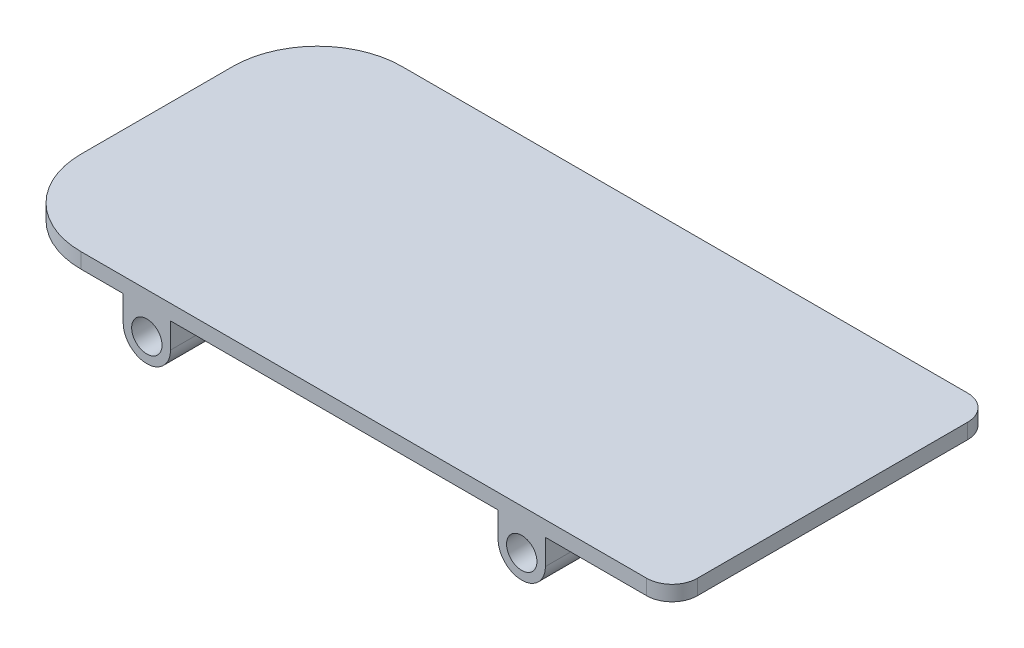
ISO-10303-21;
HEADER;
FILE_DESCRIPTION(('STEP AP214'),'2;1');
FILE_NAME('part.step','',(''),(''),'','','');
FILE_SCHEMA(('AUTOMOTIVE_DESIGN { 1 0 10303 214 1 1 1 1 }'));
ENDSEC;
DATA;
#1=APPLICATION_CONTEXT('core data for automotive mechanical design processes');
#2=APPLICATION_PROTOCOL_DEFINITION('international standard','automotive_design',2000,#1);
#3=PRODUCT_CONTEXT('',#1,'mechanical');
#4=PRODUCT('Part','Part','',(#3));
#5=PRODUCT_RELATED_PRODUCT_CATEGORY('part','',(#4));
#6=PRODUCT_DEFINITION_FORMATION('','',#4);
#7=PRODUCT_DEFINITION_CONTEXT('part definition',#1,'design');
#8=PRODUCT_DEFINITION('design','',#6,#7);
#9=PRODUCT_DEFINITION_SHAPE('','',#8);
#10=(LENGTH_UNIT() NAMED_UNIT(*) SI_UNIT(.MILLI.,.METRE.));
#11=(NAMED_UNIT(*) PLANE_ANGLE_UNIT() SI_UNIT($,.RADIAN.));
#12=(NAMED_UNIT(*) SI_UNIT($,.STERADIAN.) SOLID_ANGLE_UNIT());
#13=UNCERTAINTY_MEASURE_WITH_UNIT(LENGTH_MEASURE(1.E-05),#10,'distance_accuracy_value','');
#14=(GEOMETRIC_REPRESENTATION_CONTEXT(3) GLOBAL_UNCERTAINTY_ASSIGNED_CONTEXT((#13)) GLOBAL_UNIT_ASSIGNED_CONTEXT((#10,
#11,#12)) REPRESENTATION_CONTEXT('',''));
#15=CARTESIAN_POINT('',(0.,0.,0.));
#16=DIRECTION('',(0.,0.,1.));
#17=DIRECTION('',(1.,0.,0.));
#18=AXIS2_PLACEMENT_3D('',#15,#16,#17);
#19=CARTESIAN_POINT('',(0.,0.,380.));
#20=DIRECTION('',(0.,0.,1.));
#21=DIRECTION('',(1.,0.,0.));
#22=AXIS2_PLACEMENT_3D('',#19,#20,#21);
#23=PLANE('',#22);
#24=CARTESIAN_POINT('',(0.,0.,380.));
#25=DIRECTION('',(0.,0.,1.));
#26=DIRECTION('',(1.,0.,0.));
#27=AXIS2_PLACEMENT_3D('',#24,#25,#26);
#28=CIRCLE('',#27,18.);
#29=CARTESIAN_POINT('',(18.,0.,380.));
#30=VERTEX_POINT('',#29);
#31=EDGE_CURVE('E313',#30,#30,#28,.T.);
#32=ORIENTED_EDGE('',*,*,#31,.F.);
#33=EDGE_LOOP('',(#32));
#34=FACE_BOUND('',#33,.T.);
#35=DIRECTION('',(1.,0.,0.));
#36=VECTOR('',#35,1.);
#37=CARTESIAN_POINT('',(472.,30.,380.));
#38=LINE('',#37,#36);
#39=CARTESIAN_POINT('',(472.,30.,380.));
#40=VERTEX_POINT('',#39);
#41=CARTESIAN_POINT('',(592.,30.,380.));
#42=VERTEX_POINT('',#41);
#43=EDGE_CURVE('E214',#40,#42,#38,.T.);
#44=ORIENTED_EDGE('',*,*,#43,.T.);
#45=DIRECTION('',(0.,1.,0.));
#46=VECTOR('',#45,1.);
#47=CARTESIAN_POINT('',(592.,48.,380.));
#48=LINE('',#47,#46);
#49=CARTESIAN_POINT('',(592.,48.,380.));
#50=VERTEX_POINT('',#49);
#51=EDGE_CURVE('E198',#42,#50,#48,.T.);
#52=ORIENTED_EDGE('',*,*,#51,.T.);
#53=DIRECTION('',(-1.,0.,0.));
#54=VECTOR('',#53,1.);
#55=CARTESIAN_POINT('',(-178.,48.,380.));
#56=LINE('',#55,#54);
#57=CARTESIAN_POINT('',(-78.,48.,380.));
#58=VERTEX_POINT('',#57);
#59=EDGE_CURVE('E223',#50,#58,#56,.T.);
#60=ORIENTED_EDGE('',*,*,#59,.T.);
#61=DIRECTION('',(0.,-1.,0.));
#62=VECTOR('',#61,1.);
#63=CARTESIAN_POINT('',(-78.,30.,380.));
#64=LINE('',#63,#62);
#65=CARTESIAN_POINT('',(-78.,30.,380.));
#66=VERTEX_POINT('',#65);
#67=EDGE_CURVE('E195',#58,#66,#64,.T.);
#68=ORIENTED_EDGE('',*,*,#67,.T.);
#69=DIRECTION('',(1.,0.,0.));
#70=VECTOR('',#69,1.);
#71=CARTESIAN_POINT('',(-28.,30.,380.));
#72=LINE('',#71,#70);
#73=CARTESIAN_POINT('',(-28.,30.,380.));
#74=VERTEX_POINT('',#73);
#75=EDGE_CURVE('E308',#66,#74,#72,.T.);
#76=ORIENTED_EDGE('',*,*,#75,.T.);
#77=DIRECTION('',(0.,-1.,0.));
#78=VECTOR('',#77,1.);
#79=CARTESIAN_POINT('',(-28.,0.,380.));
#80=LINE('',#79,#78);
#81=CARTESIAN_POINT('',(-28.,0.,380.));
#82=VERTEX_POINT('',#81);
#83=EDGE_CURVE('E164',#74,#82,#80,.T.);
#84=ORIENTED_EDGE('',*,*,#83,.T.);
#85=CARTESIAN_POINT('',(0.,0.,380.));
#86=DIRECTION('',(0.,0.,1.));
#87=DIRECTION('',(1.,0.,0.));
#88=AXIS2_PLACEMENT_3D('',#85,#86,#87);
#89=CIRCLE('',#88,28.);
#90=CARTESIAN_POINT('',(28.,0.,380.));
#91=VERTEX_POINT('',#90);
#92=EDGE_CURVE('E158',#82,#91,#89,.T.);
#93=ORIENTED_EDGE('',*,*,#92,.T.);
#94=DIRECTION('',(0.,1.,0.));
#95=VECTOR('',#94,1.);
#96=CARTESIAN_POINT('',(28.,30.,380.));
#97=LINE('',#96,#95);
#98=CARTESIAN_POINT('',(28.,30.,380.));
#99=VERTEX_POINT('',#98);
#100=EDGE_CURVE('E147',#91,#99,#97,.T.);
#101=ORIENTED_EDGE('',*,*,#100,.T.);
#102=DIRECTION('',(1.,0.,0.));
#103=VECTOR('',#102,1.);
#104=CARTESIAN_POINT('',(416.,30.,380.));
#105=LINE('',#104,#103);
#106=CARTESIAN_POINT('',(416.,30.,380.));
#107=VERTEX_POINT('',#106);
#108=EDGE_CURVE('E157',#99,#107,#105,.T.);
#109=ORIENTED_EDGE('',*,*,#108,.T.);
#110=DIRECTION('',(0.,-1.,0.));
#111=VECTOR('',#110,1.);
#112=CARTESIAN_POINT('',(416.,30.,380.));
#113=LINE('',#112,#111);
#114=CARTESIAN_POINT('',(416.,0.,380.));
#115=VERTEX_POINT('',#114);
#116=EDGE_CURVE('E257',#107,#115,#113,.T.);
#117=ORIENTED_EDGE('',*,*,#116,.T.);
#118=CARTESIAN_POINT('',(444.,0.,380.));
#119=DIRECTION('',(0.,0.,1.));
#120=DIRECTION('',(-1.,0.,0.));
#121=AXIS2_PLACEMENT_3D('',#118,#119,#120);
#122=CIRCLE('',#121,28.);
#123=CARTESIAN_POINT('',(472.,0.,380.));
#124=VERTEX_POINT('',#123);
#125=EDGE_CURVE('E316',#115,#124,#122,.T.);
#126=ORIENTED_EDGE('',*,*,#125,.T.);
#127=DIRECTION('',(0.,1.,0.));
#128=VECTOR('',#127,1.);
#129=CARTESIAN_POINT('',(472.,0.,380.));
#130=LINE('',#129,#128);
#131=EDGE_CURVE('E221',#124,#40,#130,.T.);
#132=ORIENTED_EDGE('',*,*,#131,.T.);
#133=EDGE_LOOP('',(#44,#52,#60,#68,#76,#84,#93,#101,#109,#117,#126,#132));
#134=FACE_BOUND('',#133,.T.);
#135=CARTESIAN_POINT('',(444.,0.,380.));
#136=DIRECTION('',(0.,0.,1.));
#137=DIRECTION('',(-1.,0.,0.));
#138=AXIS2_PLACEMENT_3D('',#135,#136,#137);
#139=CIRCLE('',#138,18.);
#140=CARTESIAN_POINT('',(426.,0.,380.));
#141=VERTEX_POINT('',#140);
#142=EDGE_CURVE('E484',#141,#141,#139,.T.);
#143=ORIENTED_EDGE('',*,*,#142,.F.);
#144=EDGE_LOOP('',(#143));
#145=FACE_BOUND('',#144,.T.);
#146=ADVANCED_FACE('F33',(#34,#134,#145),#23,.T.);
#147=CARTESIAN_POINT('',(0.,0.,0.));
#148=DIRECTION('',(0.,0.,1.));
#149=DIRECTION('',(1.,0.,0.));
#150=AXIS2_PLACEMENT_3D('',#147,#148,#149);
#151=PLANE('',#150);
#152=DIRECTION('',(-1.,0.,0.));
#153=VECTOR('',#152,1.);
#154=CARTESIAN_POINT('',(-178.,48.,0.));
#155=LINE('',#154,#153);
#156=CARTESIAN_POINT('',(592.,48.,0.));
#157=VERTEX_POINT('',#156);
#158=CARTESIAN_POINT('',(-78.,48.,0.));
#159=VERTEX_POINT('',#158);
#160=EDGE_CURVE('E276',#157,#159,#155,.T.);
#161=ORIENTED_EDGE('',*,*,#160,.F.);
#162=DIRECTION('',(0.,1.,0.));
#163=VECTOR('',#162,1.);
#164=CARTESIAN_POINT('',(592.,0.,0.));
#165=LINE('',#164,#163);
#166=CARTESIAN_POINT('',(592.,30.,0.));
#167=VERTEX_POINT('',#166);
#168=EDGE_CURVE('E11',#157,#167,#165,.F.);
#169=ORIENTED_EDGE('',*,*,#168,.T.);
#170=DIRECTION('',(1.,0.,0.));
#171=VECTOR('',#170,1.);
#172=CARTESIAN_POINT('',(472.,30.,0.));
#173=LINE('',#172,#171);
#174=CARTESIAN_POINT('',(472.,30.,0.));
#175=VERTEX_POINT('',#174);
#176=EDGE_CURVE('E274',#175,#167,#173,.T.);
#177=ORIENTED_EDGE('',*,*,#176,.F.);
#178=DIRECTION('',(0.,1.,0.));
#179=VECTOR('',#178,1.);
#180=CARTESIAN_POINT('',(472.,0.,0.));
#181=LINE('',#180,#179);
#182=CARTESIAN_POINT('',(472.,0.,0.));
#183=VERTEX_POINT('',#182);
#184=EDGE_CURVE('E267',#183,#175,#181,.T.);
#185=ORIENTED_EDGE('',*,*,#184,.F.);
#186=CARTESIAN_POINT('',(444.,0.,0.));
#187=DIRECTION('',(0.,0.,1.));
#188=DIRECTION('',(-1.,0.,0.));
#189=AXIS2_PLACEMENT_3D('',#186,#187,#188);
#190=CIRCLE('',#189,28.);
#191=CARTESIAN_POINT('',(416.,0.,0.));
#192=VERTEX_POINT('',#191);
#193=EDGE_CURVE('E265',#192,#183,#190,.T.);
#194=ORIENTED_EDGE('',*,*,#193,.F.);
#195=DIRECTION('',(0.,-1.,0.));
#196=VECTOR('',#195,1.);
#197=CARTESIAN_POINT('',(416.,30.,0.));
#198=LINE('',#197,#196);
#199=CARTESIAN_POINT('',(416.,30.,0.));
#200=VERTEX_POINT('',#199);
#201=EDGE_CURVE('E256',#200,#192,#198,.T.);
#202=ORIENTED_EDGE('',*,*,#201,.F.);
#203=DIRECTION('',(1.,0.,0.));
#204=VECTOR('',#203,1.);
#205=CARTESIAN_POINT('',(416.,30.,0.));
#206=LINE('',#205,#204);
#207=CARTESIAN_POINT('',(28.,30.,0.));
#208=VERTEX_POINT('',#207);
#209=EDGE_CURVE('E263',#208,#200,#206,.T.);
#210=ORIENTED_EDGE('',*,*,#209,.F.);
#211=DIRECTION('',(0.,1.,0.));
#212=VECTOR('',#211,1.);
#213=CARTESIAN_POINT('',(28.,30.,0.));
#214=LINE('',#213,#212);
#215=CARTESIAN_POINT('',(28.,0.,0.));
#216=VERTEX_POINT('',#215);
#217=EDGE_CURVE('E269',#216,#208,#214,.T.);
#218=ORIENTED_EDGE('',*,*,#217,.F.);
#219=CARTESIAN_POINT('',(0.,0.,0.));
#220=DIRECTION('',(0.,0.,1.));
#221=DIRECTION('',(1.,0.,0.));
#222=AXIS2_PLACEMENT_3D('',#219,#220,#221);
#223=CIRCLE('',#222,28.);
#224=CARTESIAN_POINT('',(-28.,0.,0.));
#225=VERTEX_POINT('',#224);
#226=EDGE_CURVE('E172',#225,#216,#223,.T.);
#227=ORIENTED_EDGE('',*,*,#226,.F.);
#228=DIRECTION('',(0.,-1.,0.));
#229=VECTOR('',#228,1.);
#230=CARTESIAN_POINT('',(-28.,0.,0.));
#231=LINE('',#230,#229);
#232=CARTESIAN_POINT('',(-28.,30.,0.));
#233=VERTEX_POINT('',#232);
#234=EDGE_CURVE('E168',#233,#225,#231,.T.);
#235=ORIENTED_EDGE('',*,*,#234,.F.);
#236=DIRECTION('',(1.,0.,0.));
#237=VECTOR('',#236,1.);
#238=CARTESIAN_POINT('',(-28.,30.,0.));
#239=LINE('',#238,#237);
#240=CARTESIAN_POINT('',(-78.,30.,0.));
#241=VERTEX_POINT('',#240);
#242=EDGE_CURVE('E278',#241,#233,#239,.T.);
#243=ORIENTED_EDGE('',*,*,#242,.F.);
#244=DIRECTION('',(0.,-1.,0.));
#245=VECTOR('',#244,1.);
#246=CARTESIAN_POINT('',(-78.,0.,0.));
#247=LINE('',#246,#245);
#248=EDGE_CURVE('E187',#241,#159,#247,.F.);
#249=ORIENTED_EDGE('',*,*,#248,.T.);
#250=EDGE_LOOP('',(#161,#169,#177,#185,#194,#202,#210,#218,#227,#235,#243,#249));
#251=FACE_BOUND('',#250,.T.);
#252=CARTESIAN_POINT('',(0.,0.,0.));
#253=DIRECTION('',(0.,0.,1.));
#254=DIRECTION('',(1.,0.,0.));
#255=AXIS2_PLACEMENT_3D('',#252,#253,#254);
#256=CIRCLE('',#255,18.);
#257=CARTESIAN_POINT('',(18.,0.,0.));
#258=VERTEX_POINT('',#257);
#259=EDGE_CURVE('E490',#258,#258,#256,.T.);
#260=ORIENTED_EDGE('',*,*,#259,.T.);
#261=EDGE_LOOP('',(#260));
#262=FACE_BOUND('',#261,.T.);
#263=CARTESIAN_POINT('',(444.,0.,0.));
#264=DIRECTION('',(0.,0.,1.));
#265=DIRECTION('',(-1.,0.,0.));
#266=AXIS2_PLACEMENT_3D('',#263,#264,#265);
#267=CIRCLE('',#266,18.);
#268=CARTESIAN_POINT('',(426.,0.,0.));
#269=VERTEX_POINT('',#268);
#270=EDGE_CURVE('E487',#269,#269,#267,.T.);
#271=ORIENTED_EDGE('',*,*,#270,.T.);
#272=EDGE_LOOP('',(#271));
#273=FACE_BOUND('',#272,.T.);
#274=ADVANCED_FACE('F261',(#251,#262,#273),#151,.F.);
#275=CARTESIAN_POINT('',(0.,0.,380.));
#276=DIRECTION('',(0.,0.,-1.));
#277=DIRECTION('',(-1.,0.,0.));
#278=AXIS2_PLACEMENT_3D('',#275,#276,#277);
#279=CYLINDRICAL_SURFACE('',#278,28.);
#280=ORIENTED_EDGE('',*,*,#226,.T.);
#281=DIRECTION('',(0.,0.,-1.));
#282=VECTOR('',#281,1.);
#283=CARTESIAN_POINT('',(28.,0.,380.));
#284=LINE('',#283,#282);
#285=EDGE_CURVE('E151',#91,#216,#284,.T.);
#286=ORIENTED_EDGE('',*,*,#285,.F.);
#287=ORIENTED_EDGE('',*,*,#92,.F.);
#288=DIRECTION('',(0.,0.,-1.));
#289=VECTOR('',#288,1.);
#290=CARTESIAN_POINT('',(-28.,0.,380.));
#291=LINE('',#290,#289);
#292=EDGE_CURVE('E281',#82,#225,#291,.T.);
#293=ORIENTED_EDGE('',*,*,#292,.T.);
#294=EDGE_LOOP('',(#280,#286,#287,#293));
#295=FACE_BOUND('',#294,.T.);
#296=ADVANCED_FACE('F170',(#295),#279,.T.);
#297=CARTESIAN_POINT('',(28.,30.,380.));
#298=DIRECTION('',(-1.,0.,0.));
#299=DIRECTION('',(0.,0.,1.));
#300=AXIS2_PLACEMENT_3D('',#297,#298,#299);
#301=PLANE('',#300);
#302=ORIENTED_EDGE('',*,*,#217,.T.);
#303=DIRECTION('',(0.,0.,-1.));
#304=VECTOR('',#303,1.);
#305=CARTESIAN_POINT('',(28.,30.,380.));
#306=LINE('',#305,#304);
#307=EDGE_CURVE('E154',#99,#208,#306,.T.);
#308=ORIENTED_EDGE('',*,*,#307,.F.);
#309=ORIENTED_EDGE('',*,*,#100,.F.);
#310=ORIENTED_EDGE('',*,*,#285,.T.);
#311=EDGE_LOOP('',(#302,#308,#309,#310));
#312=FACE_BOUND('',#311,.T.);
#313=ADVANCED_FACE('F149',(#312),#301,.F.);
#314=CARTESIAN_POINT('',(416.,30.,380.));
#315=DIRECTION('',(0.,1.,0.));
#316=DIRECTION('',(-1.,0.,0.));
#317=AXIS2_PLACEMENT_3D('',#314,#315,#316);
#318=PLANE('',#317);
#319=ORIENTED_EDGE('',*,*,#209,.T.);
#320=DIRECTION('',(0.,0.,-1.));
#321=VECTOR('',#320,1.);
#322=CARTESIAN_POINT('',(416.,30.,380.));
#323=LINE('',#322,#321);
#324=EDGE_CURVE('E177',#107,#200,#323,.T.);
#325=ORIENTED_EDGE('',*,*,#324,.F.);
#326=ORIENTED_EDGE('',*,*,#108,.F.);
#327=ORIENTED_EDGE('',*,*,#307,.T.);
#328=EDGE_LOOP('',(#319,#325,#326,#327));
#329=FACE_BOUND('',#328,.T.);
#330=ADVANCED_FACE('F314',(#329),#318,.F.);
#331=CARTESIAN_POINT('',(416.,30.,380.));
#332=DIRECTION('',(1.,0.,0.));
#333=DIRECTION('',(0.,0.,-1.));
#334=AXIS2_PLACEMENT_3D('',#331,#332,#333);
#335=PLANE('',#334);
#336=ORIENTED_EDGE('',*,*,#201,.T.);
#337=DIRECTION('',(0.,0.,-1.));
#338=VECTOR('',#337,1.);
#339=CARTESIAN_POINT('',(416.,0.,380.));
#340=LINE('',#339,#338);
#341=EDGE_CURVE('E247',#115,#192,#340,.T.);
#342=ORIENTED_EDGE('',*,*,#341,.F.);
#343=ORIENTED_EDGE('',*,*,#116,.F.);
#344=ORIENTED_EDGE('',*,*,#324,.T.);
#345=EDGE_LOOP('',(#336,#342,#343,#344));
#346=FACE_BOUND('',#345,.T.);
#347=ADVANCED_FACE('F254',(#346),#335,.F.);
#348=CARTESIAN_POINT('',(444.,0.,380.));
#349=DIRECTION('',(0.,0.,-1.));
#350=DIRECTION('',(-1.,0.,0.));
#351=AXIS2_PLACEMENT_3D('',#348,#349,#350);
#352=CYLINDRICAL_SURFACE('',#351,28.);
#353=ORIENTED_EDGE('',*,*,#193,.T.);
#354=DIRECTION('',(0.,0.,-1.));
#355=VECTOR('',#354,1.);
#356=CARTESIAN_POINT('',(472.,0.,380.));
#357=LINE('',#356,#355);
#358=EDGE_CURVE('E244',#124,#183,#357,.T.);
#359=ORIENTED_EDGE('',*,*,#358,.F.);
#360=ORIENTED_EDGE('',*,*,#125,.F.);
#361=ORIENTED_EDGE('',*,*,#341,.T.);
#362=EDGE_LOOP('',(#353,#359,#360,#361));
#363=FACE_BOUND('',#362,.T.);
#364=ADVANCED_FACE('F323',(#363),#352,.T.);
#365=CARTESIAN_POINT('',(472.,0.,380.));
#366=DIRECTION('',(-1.,0.,0.));
#367=DIRECTION('',(0.,0.,1.));
#368=AXIS2_PLACEMENT_3D('',#365,#366,#367);
#369=PLANE('',#368);
#370=ORIENTED_EDGE('',*,*,#184,.T.);
#371=DIRECTION('',(0.,0.,-1.));
#372=VECTOR('',#371,1.);
#373=CARTESIAN_POINT('',(472.,30.,380.));
#374=LINE('',#373,#372);
#375=EDGE_CURVE('E236',#40,#175,#374,.T.);
#376=ORIENTED_EDGE('',*,*,#375,.F.);
#377=ORIENTED_EDGE('',*,*,#131,.F.);
#378=ORIENTED_EDGE('',*,*,#358,.T.);
#379=EDGE_LOOP('',(#370,#376,#377,#378));
#380=FACE_BOUND('',#379,.T.);
#381=ADVANCED_FACE('F325',(#380),#369,.F.);
#382=CARTESIAN_POINT('',(472.,30.,380.));
#383=DIRECTION('',(0.,1.,0.));
#384=DIRECTION('',(-1.,0.,0.));
#385=AXIS2_PLACEMENT_3D('',#382,#383,#384);
#386=PLANE('',#385);
#387=DIRECTION('',(0.,0.,-1.));
#388=VECTOR('',#387,1.);
#389=CARTESIAN_POINT('',(622.,30.,380.));
#390=LINE('',#389,#388);
#391=CARTESIAN_POINT('',(622.,30.,350.));
#392=VERTEX_POINT('',#391);
#393=CARTESIAN_POINT('',(622.,30.,30.));
#394=VERTEX_POINT('',#393);
#395=EDGE_CURVE('E215',#392,#394,#390,.T.);
#396=ORIENTED_EDGE('',*,*,#395,.F.);
#397=CARTESIAN_POINT('',(592.,30.,350.));
#398=DIRECTION('',(0.,1.,0.));
#399=DIRECTION('',(-1.,0.,0.));
#400=AXIS2_PLACEMENT_3D('',#397,#398,#399);
#401=CIRCLE('',#400,30.);
#402=EDGE_CURVE('E41',#392,#42,#401,.F.);
#403=ORIENTED_EDGE('',*,*,#402,.T.);
#404=ORIENTED_EDGE('',*,*,#43,.F.);
#405=ORIENTED_EDGE('',*,*,#375,.T.);
#406=ORIENTED_EDGE('',*,*,#176,.T.);
#407=CARTESIAN_POINT('',(592.,30.,30.));
#408=DIRECTION('',(0.,1.,0.));
#409=DIRECTION('',(-1.,0.,0.));
#410=AXIS2_PLACEMENT_3D('',#407,#408,#409);
#411=CIRCLE('',#410,30.);
#412=EDGE_CURVE('E53',#167,#394,#411,.F.);
#413=ORIENTED_EDGE('',*,*,#412,.T.);
#414=EDGE_LOOP('',(#396,#403,#404,#405,#406,#413));
#415=FACE_BOUND('',#414,.T.);
#416=ADVANCED_FACE('F212',(#415),#386,.F.);
#417=CARTESIAN_POINT('',(622.,30.,380.));
#418=DIRECTION('',(-1.,0.,0.));
#419=DIRECTION('',(0.,0.,1.));
#420=AXIS2_PLACEMENT_3D('',#417,#418,#419);
#421=PLANE('',#420);
#422=DIRECTION('',(0.,0.,-1.));
#423=VECTOR('',#422,1.);
#424=CARTESIAN_POINT('',(622.,48.,380.));
#425=LINE('',#424,#423);
#426=CARTESIAN_POINT('',(622.,48.,350.));
#427=VERTEX_POINT('',#426);
#428=CARTESIAN_POINT('',(622.,48.,30.));
#429=VERTEX_POINT('',#428);
#430=EDGE_CURVE('E230',#427,#429,#425,.T.);
#431=ORIENTED_EDGE('',*,*,#430,.F.);
#432=DIRECTION('',(0.,1.,0.));
#433=VECTOR('',#432,1.);
#434=CARTESIAN_POINT('',(622.,30.,350.));
#435=LINE('',#434,#433);
#436=EDGE_CURVE('E208',#427,#392,#435,.F.);
#437=ORIENTED_EDGE('',*,*,#436,.T.);
#438=ORIENTED_EDGE('',*,*,#395,.T.);
#439=DIRECTION('',(0.,1.,0.));
#440=VECTOR('',#439,1.);
#441=CARTESIAN_POINT('',(622.,30.,30.));
#442=LINE('',#441,#440);
#443=EDGE_CURVE('E205',#394,#429,#442,.T.);
#444=ORIENTED_EDGE('',*,*,#443,.T.);
#445=EDGE_LOOP('',(#431,#437,#438,#444));
#446=FACE_BOUND('',#445,.T.);
#447=ADVANCED_FACE('F232',(#446),#421,.F.);
#448=CARTESIAN_POINT('',(-178.,48.,380.));
#449=DIRECTION('',(0.,-1.,0.));
#450=DIRECTION('',(0.,0.,-1.));
#451=AXIS2_PLACEMENT_3D('',#448,#449,#450);
#452=PLANE('',#451);
#453=ORIENTED_EDGE('',*,*,#59,.F.);
#454=CARTESIAN_POINT('',(592.,48.,350.));
#455=DIRECTION('',(0.,-1.,0.));
#456=DIRECTION('',(0.,0.,-1.));
#457=AXIS2_PLACEMENT_3D('',#454,#455,#456);
#458=CIRCLE('',#457,30.);
#459=EDGE_CURVE('E203',#50,#427,#458,.F.);
#460=ORIENTED_EDGE('',*,*,#459,.T.);
#461=ORIENTED_EDGE('',*,*,#430,.T.);
#462=CARTESIAN_POINT('',(592.,48.,30.));
#463=DIRECTION('',(0.,-1.,0.));
#464=DIRECTION('',(0.,0.,-1.));
#465=AXIS2_PLACEMENT_3D('',#462,#463,#464);
#466=CIRCLE('',#465,30.);
#467=EDGE_CURVE('E201',#429,#157,#466,.F.);
#468=ORIENTED_EDGE('',*,*,#467,.T.);
#469=ORIENTED_EDGE('',*,*,#160,.T.);
#470=CARTESIAN_POINT('',(-78.,48.,100.));
#471=DIRECTION('',(0.,-1.,0.));
#472=DIRECTION('',(0.,0.,-1.));
#473=AXIS2_PLACEMENT_3D('',#470,#471,#472);
#474=CIRCLE('',#473,100.);
#475=CARTESIAN_POINT('',(-178.,48.,100.));
#476=VERTEX_POINT('',#475);
#477=EDGE_CURVE('E193',#159,#476,#474,.F.);
#478=ORIENTED_EDGE('',*,*,#477,.T.);
#479=DIRECTION('',(0.,0.,-1.));
#480=VECTOR('',#479,1.);
#481=CARTESIAN_POINT('',(-178.,48.,380.));
#482=LINE('',#481,#480);
#483=CARTESIAN_POINT('',(-178.,48.,280.));
#484=VERTEX_POINT('',#483);
#485=EDGE_CURVE('E234',#484,#476,#482,.T.);
#486=ORIENTED_EDGE('',*,*,#485,.F.);
#487=CARTESIAN_POINT('',(-78.,48.,280.));
#488=DIRECTION('',(0.,-1.,0.));
#489=DIRECTION('',(0.,0.,-1.));
#490=AXIS2_PLACEMENT_3D('',#487,#488,#489);
#491=CIRCLE('',#490,100.);
#492=EDGE_CURVE('E190',#484,#58,#491,.F.);
#493=ORIENTED_EDGE('',*,*,#492,.T.);
#494=EDGE_LOOP('',(#453,#460,#461,#468,#469,#478,#486,#493));
#495=FACE_BOUND('',#494,.T.);
#496=ADVANCED_FACE('F229',(#495),#452,.F.);
#497=CARTESIAN_POINT('',(-178.,30.,380.));
#498=DIRECTION('',(1.,0.,0.));
#499=DIRECTION('',(0.,0.,-1.));
#500=AXIS2_PLACEMENT_3D('',#497,#498,#499);
#501=PLANE('',#500);
#502=ORIENTED_EDGE('',*,*,#485,.T.);
#503=DIRECTION('',(0.,-1.,0.));
#504=VECTOR('',#503,1.);
#505=CARTESIAN_POINT('',(-178.,30.,100.));
#506=LINE('',#505,#504);
#507=CARTESIAN_POINT('',(-178.,30.,100.));
#508=VERTEX_POINT('',#507);
#509=EDGE_CURVE('E175',#476,#508,#506,.T.);
#510=ORIENTED_EDGE('',*,*,#509,.T.);
#511=DIRECTION('',(0.,0.,-1.));
#512=VECTOR('',#511,1.);
#513=CARTESIAN_POINT('',(-178.,30.,380.));
#514=LINE('',#513,#512);
#515=CARTESIAN_POINT('',(-178.,30.,280.));
#516=VERTEX_POINT('',#515);
#517=EDGE_CURVE('E239',#516,#508,#514,.T.);
#518=ORIENTED_EDGE('',*,*,#517,.F.);
#519=DIRECTION('',(0.,-1.,0.));
#520=VECTOR('',#519,1.);
#521=CARTESIAN_POINT('',(-178.,48.,280.));
#522=LINE('',#521,#520);
#523=EDGE_CURVE('E173',#516,#484,#522,.F.);
#524=ORIENTED_EDGE('',*,*,#523,.T.);
#525=EDGE_LOOP('',(#502,#510,#518,#524));
#526=FACE_BOUND('',#525,.T.);
#527=ADVANCED_FACE('F293',(#526),#501,.F.);
#528=CARTESIAN_POINT('',(-28.,30.,380.));
#529=DIRECTION('',(0.,1.,0.));
#530=DIRECTION('',(-1.,0.,0.));
#531=AXIS2_PLACEMENT_3D('',#528,#529,#530);
#532=PLANE('',#531);
#533=ORIENTED_EDGE('',*,*,#517,.T.);
#534=CARTESIAN_POINT('',(-78.,30.,100.));
#535=DIRECTION('',(0.,1.,0.));
#536=DIRECTION('',(-1.,0.,0.));
#537=AXIS2_PLACEMENT_3D('',#534,#535,#536);
#538=CIRCLE('',#537,100.);
#539=EDGE_CURVE('E185',#508,#241,#538,.F.);
#540=ORIENTED_EDGE('',*,*,#539,.T.);
#541=ORIENTED_EDGE('',*,*,#242,.T.);
#542=DIRECTION('',(0.,0.,-1.));
#543=VECTOR('',#542,1.);
#544=CARTESIAN_POINT('',(-28.,30.,380.));
#545=LINE('',#544,#543);
#546=EDGE_CURVE('E283',#74,#233,#545,.T.);
#547=ORIENTED_EDGE('',*,*,#546,.F.);
#548=ORIENTED_EDGE('',*,*,#75,.F.);
#549=CARTESIAN_POINT('',(-78.,30.,280.));
#550=DIRECTION('',(0.,1.,0.));
#551=DIRECTION('',(-1.,0.,0.));
#552=AXIS2_PLACEMENT_3D('',#549,#550,#551);
#553=CIRCLE('',#552,100.);
#554=EDGE_CURVE('E183',#66,#516,#553,.F.);
#555=ORIENTED_EDGE('',*,*,#554,.T.);
#556=EDGE_LOOP('',(#533,#540,#541,#547,#548,#555));
#557=FACE_BOUND('',#556,.T.);
#558=ADVANCED_FACE('F288',(#557),#532,.F.);
#559=CARTESIAN_POINT('',(-28.,0.,380.));
#560=DIRECTION('',(1.,0.,0.));
#561=DIRECTION('',(0.,0.,-1.));
#562=AXIS2_PLACEMENT_3D('',#559,#560,#561);
#563=PLANE('',#562);
#564=ORIENTED_EDGE('',*,*,#234,.T.);
#565=ORIENTED_EDGE('',*,*,#292,.F.);
#566=ORIENTED_EDGE('',*,*,#83,.F.);
#567=ORIENTED_EDGE('',*,*,#546,.T.);
#568=EDGE_LOOP('',(#564,#565,#566,#567));
#569=FACE_BOUND('',#568,.T.);
#570=ADVANCED_FACE('F307',(#569),#563,.F.);
#571=CARTESIAN_POINT('',(0.,0.,380.));
#572=DIRECTION('',(0.,0.,-1.));
#573=DIRECTION('',(-1.,0.,0.));
#574=AXIS2_PLACEMENT_3D('',#571,#572,#573);
#575=CYLINDRICAL_SURFACE('',#574,18.);
#576=ORIENTED_EDGE('',*,*,#31,.T.);
#577=EDGE_LOOP('',(#576));
#578=FACE_BOUND('',#577,.T.);
#579=ORIENTED_EDGE('',*,*,#259,.F.);
#580=EDGE_LOOP('',(#579));
#581=FACE_BOUND('',#580,.T.);
#582=ADVANCED_FACE('F340',(#578,#581),#575,.F.);
#583=CARTESIAN_POINT('',(444.,0.,380.));
#584=DIRECTION('',(0.,0.,-1.));
#585=DIRECTION('',(-1.,0.,0.));
#586=AXIS2_PLACEMENT_3D('',#583,#584,#585);
#587=CYLINDRICAL_SURFACE('',#586,18.);
#588=ORIENTED_EDGE('',*,*,#142,.T.);
#589=EDGE_LOOP('',(#588));
#590=FACE_BOUND('',#589,.T.);
#591=ORIENTED_EDGE('',*,*,#270,.F.);
#592=EDGE_LOOP('',(#591));
#593=FACE_BOUND('',#592,.T.);
#594=ADVANCED_FACE('F369',(#590,#593),#587,.F.);
#595=CARTESIAN_POINT('',(-78.,30.,100.));
#596=DIRECTION('',(0.,-1.,0.));
#597=DIRECTION('',(0.,0.,-1.));
#598=AXIS2_PLACEMENT_3D('',#595,#596,#597);
#599=CYLINDRICAL_SURFACE('',#598,100.);
#600=ORIENTED_EDGE('',*,*,#477,.F.);
#601=ORIENTED_EDGE('',*,*,#248,.F.);
#602=ORIENTED_EDGE('',*,*,#539,.F.);
#603=ORIENTED_EDGE('',*,*,#509,.F.);
#604=EDGE_LOOP('',(#600,#601,#602,#603));
#605=FACE_BOUND('',#604,.T.);
#606=ADVANCED_FACE('F302',(#605),#599,.T.);
#607=CARTESIAN_POINT('',(-78.,0.,280.));
#608=DIRECTION('',(0.,1.,0.));
#609=DIRECTION('',(0.,0.,1.));
#610=AXIS2_PLACEMENT_3D('',#607,#608,#609);
#611=CYLINDRICAL_SURFACE('',#610,100.);
#612=ORIENTED_EDGE('',*,*,#492,.F.);
#613=ORIENTED_EDGE('',*,*,#523,.F.);
#614=ORIENTED_EDGE('',*,*,#554,.F.);
#615=ORIENTED_EDGE('',*,*,#67,.F.);
#616=EDGE_LOOP('',(#612,#613,#614,#615));
#617=FACE_BOUND('',#616,.T.);
#618=ADVANCED_FACE('F298',(#617),#611,.T.);
#619=CARTESIAN_POINT('',(592.,0.,350.));
#620=DIRECTION('',(0.,-1.,0.));
#621=DIRECTION('',(0.,0.,-1.));
#622=AXIS2_PLACEMENT_3D('',#619,#620,#621);
#623=CYLINDRICAL_SURFACE('',#622,30.);
#624=ORIENTED_EDGE('',*,*,#402,.F.);
#625=ORIENTED_EDGE('',*,*,#436,.F.);
#626=ORIENTED_EDGE('',*,*,#459,.F.);
#627=ORIENTED_EDGE('',*,*,#51,.F.);
#628=EDGE_LOOP('',(#624,#625,#626,#627));
#629=FACE_BOUND('',#628,.T.);
#630=ADVANCED_FACE('F225',(#629),#623,.T.);
#631=CARTESIAN_POINT('',(592.,30.,30.));
#632=DIRECTION('',(0.,1.,0.));
#633=DIRECTION('',(0.,0.,1.));
#634=AXIS2_PLACEMENT_3D('',#631,#632,#633);
#635=CYLINDRICAL_SURFACE('',#634,30.);
#636=ORIENTED_EDGE('',*,*,#412,.F.);
#637=ORIENTED_EDGE('',*,*,#168,.F.);
#638=ORIENTED_EDGE('',*,*,#467,.F.);
#639=ORIENTED_EDGE('',*,*,#443,.F.);
#640=EDGE_LOOP('',(#636,#637,#638,#639));
#641=FACE_BOUND('',#640,.T.);
#642=ADVANCED_FACE('F35',(#641),#635,.T.);
#643=CLOSED_SHELL('',(#146,#274,#296,#313,#330,#347,#364,#381,#416,#447,#496,#527,#558,#570,
#582,#594,#606,#618,#630,#642));
#644=MANIFOLD_SOLID_BREP('B2',#643);
#645=ADVANCED_BREP_SHAPE_REPRESENTATION('',(#18,#644),#14);
#646=SHAPE_DEFINITION_REPRESENTATION(#9,#645);
ENDSEC;
END-ISO-10303-21;
